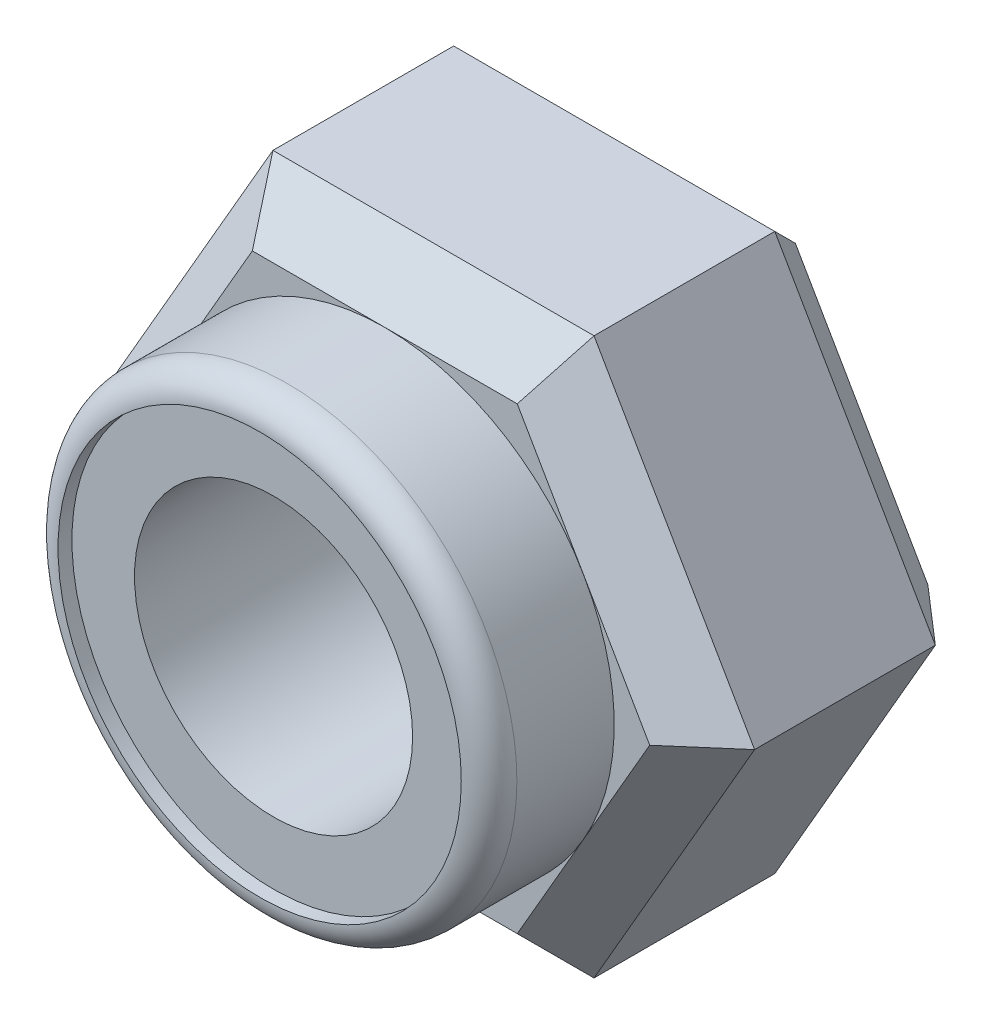
ISO-10303-21;
HEADER;
FILE_DESCRIPTION(('STEP AP214'),'2;1');
FILE_NAME('part.step','',(''),(''),'','','');
FILE_SCHEMA(('AUTOMOTIVE_DESIGN { 1 0 10303 214 1 1 1 1 }'));
ENDSEC;
DATA;
#1=APPLICATION_CONTEXT('core data for automotive mechanical design processes');
#2=APPLICATION_PROTOCOL_DEFINITION('international standard','automotive_design',2000,#1);
#3=PRODUCT_CONTEXT('',#1,'mechanical');
#4=PRODUCT('Part','Part','',(#3));
#5=PRODUCT_RELATED_PRODUCT_CATEGORY('part','',(#4));
#6=PRODUCT_DEFINITION_FORMATION('','',#4);
#7=PRODUCT_DEFINITION_CONTEXT('part definition',#1,'design');
#8=PRODUCT_DEFINITION('design','',#6,#7);
#9=PRODUCT_DEFINITION_SHAPE('','',#8);
#10=(LENGTH_UNIT() NAMED_UNIT(*) SI_UNIT(.MILLI.,.METRE.));
#11=(NAMED_UNIT(*) PLANE_ANGLE_UNIT() SI_UNIT($,.RADIAN.));
#12=(NAMED_UNIT(*) SI_UNIT($,.STERADIAN.) SOLID_ANGLE_UNIT());
#13=UNCERTAINTY_MEASURE_WITH_UNIT(LENGTH_MEASURE(1.E-05),#10,'distance_accuracy_value','');
#14=(GEOMETRIC_REPRESENTATION_CONTEXT(3) GLOBAL_UNCERTAINTY_ASSIGNED_CONTEXT((#13)) GLOBAL_UNIT_ASSIGNED_CONTEXT((#10,
#11,#12)) REPRESENTATION_CONTEXT('',''));
#15=CARTESIAN_POINT('',(0.,0.,0.));
#16=DIRECTION('',(0.,0.,1.));
#17=DIRECTION('',(1.,0.,0.));
#18=AXIS2_PLACEMENT_3D('',#15,#16,#17);
#19=CARTESIAN_POINT('',(0.,0.,2.));
#20=DIRECTION('',(0.,0.,-1.));
#21=DIRECTION('',(-1.,0.,0.));
#22=AXIS2_PLACEMENT_3D('',#19,#20,#21);
#23=CYLINDRICAL_SURFACE('',#22,1.);
#24=CARTESIAN_POINT('',(0.,0.,0.));
#25=DIRECTION('',(0.,0.,1.));
#26=DIRECTION('',(1.,0.,0.));
#27=AXIS2_PLACEMENT_3D('',#24,#25,#26);
#28=CIRCLE('',#27,1.);
#29=CARTESIAN_POINT('',(1.,0.,0.));
#30=VERTEX_POINT('',#29);
#31=EDGE_CURVE('E178',#30,#30,#28,.T.);
#32=ORIENTED_EDGE('',*,*,#31,.F.);
#33=EDGE_LOOP('',(#32));
#34=FACE_BOUND('',#33,.T.);
#35=CARTESIAN_POINT('',(0.,0.,2.8));
#36=DIRECTION('',(0.,0.,1.));
#37=DIRECTION('',(1.,0.,0.));
#38=AXIS2_PLACEMENT_3D('',#35,#36,#37);
#39=CIRCLE('',#38,1.);
#40=CARTESIAN_POINT('',(1.,0.,2.8));
#41=VERTEX_POINT('',#40);
#42=EDGE_CURVE('E393',#41,#41,#39,.T.);
#43=ORIENTED_EDGE('',*,*,#42,.T.);
#44=EDGE_LOOP('',(#43));
#45=FACE_BOUND('',#44,.T.);
#46=ADVANCED_FACE('F36',(#34,#45),#23,.F.);
#47=CARTESIAN_POINT('',(0.,0.,2.));
#48=DIRECTION('',(0.,0.,1.));
#49=DIRECTION('',(1.,0.,0.));
#50=AXIS2_PLACEMENT_3D('',#47,#48,#49);
#51=PLANE('',#50);
#52=CARTESIAN_POINT('',(0.,0.,2.));
#53=DIRECTION('',(0.,0.,1.));
#54=DIRECTION('',(1.,0.,0.));
#55=AXIS2_PLACEMENT_3D('',#52,#53,#54);
#56=CIRCLE('',#55,1.65);
#57=CARTESIAN_POINT('',(1.42894191624432,0.825,2.));
#58=VERTEX_POINT('',#57);
#59=CARTESIAN_POINT('',(0.,1.65,2.));
#60=VERTEX_POINT('',#59);
#61=EDGE_CURVE('E166',#58,#60,#56,.T.);
#62=ORIENTED_EDGE('',*,*,#61,.F.);
#63=DIRECTION('',(-0.5,0.866025403784439,0.));
#64=VECTOR('',#63,1.);
#65=CARTESIAN_POINT('',(0.851591647054698,1.825,2.));
#66=LINE('',#65,#64);
#67=CARTESIAN_POINT('',(0.952627944162882,1.65,2.));
#68=VERTEX_POINT('',#67);
#69=EDGE_CURVE('E153',#58,#68,#66,.T.);
#70=ORIENTED_EDGE('',*,*,#69,.T.);
#71=DIRECTION('',(-1.,0.,0.));
#72=VECTOR('',#71,1.);
#73=CARTESIAN_POINT('',(-1.15470053837925,1.65,2.));
#74=LINE('',#73,#72);
#75=EDGE_CURVE('E168',#68,#60,#74,.T.);
#76=ORIENTED_EDGE('',*,*,#75,.T.);
#77=EDGE_LOOP('',(#62,#70,#76));
#78=FACE_BOUND('',#77,.T.);
#79=ADVANCED_FACE('F167',(#78),#51,.T.);
#80=CARTESIAN_POINT('',(-1.42894191624432,0.824999999999999,2.));
#81=VERTEX_POINT('',#80);
#82=EDGE_CURVE('E44',#60,#81,#56,.T.);
#83=ORIENTED_EDGE('',*,*,#82,.F.);
#84=CARTESIAN_POINT('',(-0.952627944162882,1.65,2.));
#85=VERTEX_POINT('',#84);
#86=EDGE_CURVE('E239',#60,#85,#74,.T.);
#87=ORIENTED_EDGE('',*,*,#86,.T.);
#88=DIRECTION('',(-0.5,-0.866025403784439,0.));
#89=VECTOR('',#88,1.);
#90=CARTESIAN_POINT('',(-2.00629218543395,-0.175000000000001,2.));
#91=LINE('',#90,#89);
#92=EDGE_CURVE('E242',#85,#81,#91,.T.);
#93=ORIENTED_EDGE('',*,*,#92,.T.);
#94=EDGE_LOOP('',(#83,#87,#93));
#95=FACE_BOUND('',#94,.T.);
#96=ADVANCED_FACE('F352',(#95),#51,.T.);
#97=CARTESIAN_POINT('',(-1.42894191624432,-0.825,2.));
#98=VERTEX_POINT('',#97);
#99=EDGE_CURVE('E359',#81,#98,#56,.T.);
#100=ORIENTED_EDGE('',*,*,#99,.F.);
#101=CARTESIAN_POINT('',(-1.90525588832576,0.,2.));
#102=VERTEX_POINT('',#101);
#103=EDGE_CURVE('E241',#81,#102,#91,.T.);
#104=ORIENTED_EDGE('',*,*,#103,.T.);
#105=DIRECTION('',(0.5,-0.866025403784439,0.));
#106=VECTOR('',#105,1.);
#107=CARTESIAN_POINT('',(-0.851591647054698,-1.825,2.));
#108=LINE('',#107,#106);
#109=EDGE_CURVE('E246',#102,#98,#108,.T.);
#110=ORIENTED_EDGE('',*,*,#109,.T.);
#111=EDGE_LOOP('',(#100,#104,#110));
#112=FACE_BOUND('',#111,.T.);
#113=ADVANCED_FACE('F357',(#112),#51,.T.);
#114=CARTESIAN_POINT('',(0.,-1.65,2.));
#115=VERTEX_POINT('',#114);
#116=EDGE_CURVE('E59',#98,#115,#56,.T.);
#117=ORIENTED_EDGE('',*,*,#116,.F.);
#118=CARTESIAN_POINT('',(-0.952627944162882,-1.65,2.));
#119=VERTEX_POINT('',#118);
#120=EDGE_CURVE('E245',#98,#119,#108,.T.);
#121=ORIENTED_EDGE('',*,*,#120,.T.);
#122=DIRECTION('',(1.,0.,0.));
#123=VECTOR('',#122,1.);
#124=CARTESIAN_POINT('',(1.15470053837925,-1.65,2.));
#125=LINE('',#124,#123);
#126=EDGE_CURVE('E250',#119,#115,#125,.T.);
#127=ORIENTED_EDGE('',*,*,#126,.T.);
#128=EDGE_LOOP('',(#117,#121,#127));
#129=FACE_BOUND('',#128,.T.);
#130=ADVANCED_FACE('F361',(#129),#51,.T.);
#131=CARTESIAN_POINT('',(1.42894191624432,-0.824999999999999,2.));
#132=VERTEX_POINT('',#131);
#133=EDGE_CURVE('E51',#115,#132,#56,.T.);
#134=ORIENTED_EDGE('',*,*,#133,.F.);
#135=CARTESIAN_POINT('',(0.952627944162882,-1.65,2.));
#136=VERTEX_POINT('',#135);
#137=EDGE_CURVE('E249',#115,#136,#125,.T.);
#138=ORIENTED_EDGE('',*,*,#137,.T.);
#139=DIRECTION('',(0.5,0.866025403784439,0.));
#140=VECTOR('',#139,1.);
#141=CARTESIAN_POINT('',(2.00629218543395,0.175000000000002,2.));
#142=LINE('',#141,#140);
#143=EDGE_CURVE('E164',#136,#132,#142,.T.);
#144=ORIENTED_EDGE('',*,*,#143,.T.);
#145=EDGE_LOOP('',(#134,#138,#144));
#146=FACE_BOUND('',#145,.T.);
#147=ADVANCED_FACE('F367',(#146),#51,.T.);
#148=EDGE_CURVE('E148',#132,#58,#56,.T.);
#149=ORIENTED_EDGE('',*,*,#148,.F.);
#150=CARTESIAN_POINT('',(1.90525588832576,0.,2.));
#151=VERTEX_POINT('',#150);
#152=EDGE_CURVE('E150',#132,#151,#142,.T.);
#153=ORIENTED_EDGE('',*,*,#152,.T.);
#154=EDGE_CURVE('E144',#151,#58,#66,.T.);
#155=ORIENTED_EDGE('',*,*,#154,.T.);
#156=EDGE_LOOP('',(#149,#153,#155));
#157=FACE_BOUND('',#156,.T.);
#158=ADVANCED_FACE('F146',(#157),#51,.T.);
#159=CARTESIAN_POINT('',(0.,0.,0.));
#160=DIRECTION('',(0.,0.,1.));
#161=DIRECTION('',(1.,0.,0.));
#162=AXIS2_PLACEMENT_3D('',#159,#160,#161);
#163=PLANE('',#162);
#164=DIRECTION('',(0.5,-0.866025403784439,0.));
#165=VECTOR('',#164,1.);
#166=CARTESIAN_POINT('',(1.42894191624432,0.825,0.));
#167=LINE('',#166,#165);
#168=CARTESIAN_POINT('',(0.952627944162882,1.65,0.));
#169=VERTEX_POINT('',#168);
#170=CARTESIAN_POINT('',(1.90525588832576,0.,0.));
#171=VERTEX_POINT('',#170);
#172=EDGE_CURVE('E205',#169,#171,#167,.T.);
#173=ORIENTED_EDGE('',*,*,#172,.T.);
#174=DIRECTION('',(-0.5,-0.866025403784439,0.));
#175=VECTOR('',#174,1.);
#176=CARTESIAN_POINT('',(1.42894191624432,-0.824999999999999,0.));
#177=LINE('',#176,#175);
#178=CARTESIAN_POINT('',(0.952627944162882,-1.65,0.));
#179=VERTEX_POINT('',#178);
#180=EDGE_CURVE('E215',#171,#179,#177,.T.);
#181=ORIENTED_EDGE('',*,*,#180,.T.);
#182=DIRECTION('',(-1.,0.,0.));
#183=VECTOR('',#182,1.);
#184=CARTESIAN_POINT('',(0.,-1.65,0.));
#185=LINE('',#184,#183);
#186=CARTESIAN_POINT('',(-0.952627944162882,-1.65,0.));
#187=VERTEX_POINT('',#186);
#188=EDGE_CURVE('E213',#179,#187,#185,.T.);
#189=ORIENTED_EDGE('',*,*,#188,.T.);
#190=DIRECTION('',(-0.5,0.866025403784439,0.));
#191=VECTOR('',#190,1.);
#192=CARTESIAN_POINT('',(-1.42894191624432,-0.824999999999999,0.));
#193=LINE('',#192,#191);
#194=CARTESIAN_POINT('',(-1.90525588832576,0.,0.));
#195=VERTEX_POINT('',#194);
#196=EDGE_CURVE('E211',#187,#195,#193,.T.);
#197=ORIENTED_EDGE('',*,*,#196,.T.);
#198=DIRECTION('',(0.5,0.866025403784439,0.));
#199=VECTOR('',#198,1.);
#200=CARTESIAN_POINT('',(-1.42894191624432,0.824999999999999,0.));
#201=LINE('',#200,#199);
#202=CARTESIAN_POINT('',(-0.952627944162882,1.65,0.));
#203=VERTEX_POINT('',#202);
#204=EDGE_CURVE('E209',#195,#203,#201,.T.);
#205=ORIENTED_EDGE('',*,*,#204,.T.);
#206=DIRECTION('',(1.,0.,0.));
#207=VECTOR('',#206,1.);
#208=CARTESIAN_POINT('',(0.,1.65,0.));
#209=LINE('',#208,#207);
#210=EDGE_CURVE('E207',#203,#169,#209,.T.);
#211=ORIENTED_EDGE('',*,*,#210,.T.);
#212=EDGE_LOOP('',(#173,#181,#189,#197,#205,#211));
#213=FACE_BOUND('',#212,.T.);
#214=ORIENTED_EDGE('',*,*,#31,.T.);
#215=EDGE_LOOP('',(#214));
#216=FACE_BOUND('',#215,.T.);
#217=ADVANCED_FACE('F314',(#213,#216),#163,.F.);
#218=CARTESIAN_POINT('',(-2.3094010767585,0.,2.));
#219=DIRECTION('',(0.866025403784439,0.5,0.));
#220=DIRECTION('',(-0.5,0.866025403784439,0.));
#221=AXIS2_PLACEMENT_3D('',#218,#219,#220);
#222=PLANE('',#221);
#223=DIRECTION('',(0.,0.,-1.));
#224=VECTOR('',#223,1.);
#225=CARTESIAN_POINT('',(-2.3094010767585,0.,2.));
#226=LINE('',#225,#224);
#227=CARTESIAN_POINT('',(-2.3094010767585,0.,1.65));
#228=VERTEX_POINT('',#227);
#229=CARTESIAN_POINT('',(-2.3094010767585,0.,0.35));
#230=VERTEX_POINT('',#229);
#231=EDGE_CURVE('E181',#228,#230,#226,.T.);
#232=ORIENTED_EDGE('',*,*,#231,.T.);
#233=DIRECTION('',(0.5,-0.866025403784439,0.));
#234=VECTOR('',#233,1.);
#235=CARTESIAN_POINT('',(-2.3094010767585,0.,0.35));
#236=LINE('',#235,#234);
#237=CARTESIAN_POINT('',(-1.15470053837925,-2.,0.35));
#238=VERTEX_POINT('',#237);
#239=EDGE_CURVE('E224',#230,#238,#236,.T.);
#240=ORIENTED_EDGE('',*,*,#239,.T.);
#241=DIRECTION('',(0.,0.,-1.));
#242=VECTOR('',#241,1.);
#243=CARTESIAN_POINT('',(-1.15470053837925,-2.,2.));
#244=LINE('',#243,#242);
#245=CARTESIAN_POINT('',(-1.15470053837925,-2.,1.65));
#246=VERTEX_POINT('',#245);
#247=EDGE_CURVE('E197',#246,#238,#244,.T.);
#248=ORIENTED_EDGE('',*,*,#247,.F.);
#249=DIRECTION('',(-0.5,0.866025403784439,0.));
#250=VECTOR('',#249,1.);
#251=CARTESIAN_POINT('',(-2.3094010767585,0.,1.65));
#252=LINE('',#251,#250);
#253=EDGE_CURVE('E222',#246,#228,#252,.T.);
#254=ORIENTED_EDGE('',*,*,#253,.T.);
#255=EDGE_LOOP('',(#232,#240,#248,#254));
#256=FACE_BOUND('',#255,.T.);
#257=ADVANCED_FACE('F296',(#256),#222,.F.);
#258=CARTESIAN_POINT('',(-1.15470053837925,-2.,2.));
#259=DIRECTION('',(0.,1.,0.));
#260=DIRECTION('',(0.,0.,1.));
#261=AXIS2_PLACEMENT_3D('',#258,#259,#260);
#262=PLANE('',#261);
#263=ORIENTED_EDGE('',*,*,#247,.T.);
#264=DIRECTION('',(1.,0.,0.));
#265=VECTOR('',#264,1.);
#266=CARTESIAN_POINT('',(-1.15470053837925,-2.,0.35));
#267=LINE('',#266,#265);
#268=CARTESIAN_POINT('',(1.15470053837925,-2.,0.35));
#269=VERTEX_POINT('',#268);
#270=EDGE_CURVE('E220',#238,#269,#267,.T.);
#271=ORIENTED_EDGE('',*,*,#270,.T.);
#272=DIRECTION('',(0.,0.,-1.));
#273=VECTOR('',#272,1.);
#274=CARTESIAN_POINT('',(1.15470053837925,-2.,2.));
#275=LINE('',#274,#273);
#276=CARTESIAN_POINT('',(1.15470053837925,-2.,1.65));
#277=VERTEX_POINT('',#276);
#278=EDGE_CURVE('E194',#277,#269,#275,.T.);
#279=ORIENTED_EDGE('',*,*,#278,.F.);
#280=DIRECTION('',(-1.,0.,0.));
#281=VECTOR('',#280,1.);
#282=CARTESIAN_POINT('',(-1.15470053837925,-2.,1.65));
#283=LINE('',#282,#281);
#284=EDGE_CURVE('E218',#277,#246,#283,.T.);
#285=ORIENTED_EDGE('',*,*,#284,.T.);
#286=EDGE_LOOP('',(#263,#271,#279,#285));
#287=FACE_BOUND('',#286,.T.);
#288=ADVANCED_FACE('F323',(#287),#262,.F.);
#289=CARTESIAN_POINT('',(1.15470053837925,-2.,2.));
#290=DIRECTION('',(-0.866025403784439,0.5,0.));
#291=DIRECTION('',(-0.5,-0.866025403784439,0.));
#292=AXIS2_PLACEMENT_3D('',#289,#290,#291);
#293=PLANE('',#292);
#294=ORIENTED_EDGE('',*,*,#278,.T.);
#295=DIRECTION('',(0.5,0.866025403784439,0.));
#296=VECTOR('',#295,1.);
#297=CARTESIAN_POINT('',(1.15470053837925,-2.,0.35));
#298=LINE('',#297,#296);
#299=CARTESIAN_POINT('',(2.3094010767585,0.,0.35));
#300=VERTEX_POINT('',#299);
#301=EDGE_CURVE('E202',#269,#300,#298,.T.);
#302=ORIENTED_EDGE('',*,*,#301,.T.);
#303=DIRECTION('',(0.,0.,-1.));
#304=VECTOR('',#303,1.);
#305=CARTESIAN_POINT('',(2.3094010767585,0.,2.));
#306=LINE('',#305,#304);
#307=CARTESIAN_POINT('',(2.3094010767585,0.,1.65));
#308=VERTEX_POINT('',#307);
#309=EDGE_CURVE('E191',#308,#300,#306,.T.);
#310=ORIENTED_EDGE('',*,*,#309,.F.);
#311=DIRECTION('',(-0.5,-0.866025403784439,0.));
#312=VECTOR('',#311,1.);
#313=CARTESIAN_POINT('',(1.15470053837925,-2.,1.65));
#314=LINE('',#313,#312);
#315=EDGE_CURVE('E200',#308,#277,#314,.T.);
#316=ORIENTED_EDGE('',*,*,#315,.T.);
#317=EDGE_LOOP('',(#294,#302,#310,#316));
#318=FACE_BOUND('',#317,.T.);
#319=ADVANCED_FACE('F327',(#318),#293,.F.);
#320=CARTESIAN_POINT('',(2.3094010767585,0.,2.));
#321=DIRECTION('',(-0.866025403784439,-0.5,0.));
#322=DIRECTION('',(0.5,-0.866025403784439,0.));
#323=AXIS2_PLACEMENT_3D('',#320,#321,#322);
#324=PLANE('',#323);
#325=ORIENTED_EDGE('',*,*,#309,.T.);
#326=DIRECTION('',(-0.5,0.866025403784439,0.));
#327=VECTOR('',#326,1.);
#328=CARTESIAN_POINT('',(2.3094010767585,0.,0.35));
#329=LINE('',#328,#327);
#330=CARTESIAN_POINT('',(1.15470053837925,2.,0.35));
#331=VERTEX_POINT('',#330);
#332=EDGE_CURVE('E237',#300,#331,#329,.T.);
#333=ORIENTED_EDGE('',*,*,#332,.T.);
#334=DIRECTION('',(0.,0.,-1.));
#335=VECTOR('',#334,1.);
#336=CARTESIAN_POINT('',(1.15470053837925,2.,2.));
#337=LINE('',#336,#335);
#338=CARTESIAN_POINT('',(1.15470053837925,2.,1.65));
#339=VERTEX_POINT('',#338);
#340=EDGE_CURVE('E188',#339,#331,#337,.T.);
#341=ORIENTED_EDGE('',*,*,#340,.F.);
#342=DIRECTION('',(0.5,-0.866025403784439,0.));
#343=VECTOR('',#342,1.);
#344=CARTESIAN_POINT('',(2.3094010767585,0.,1.65));
#345=LINE('',#344,#343);
#346=EDGE_CURVE('E234',#339,#308,#345,.T.);
#347=ORIENTED_EDGE('',*,*,#346,.T.);
#348=EDGE_LOOP('',(#325,#333,#341,#347));
#349=FACE_BOUND('',#348,.T.);
#350=ADVANCED_FACE('F342',(#349),#324,.F.);
#351=CARTESIAN_POINT('',(1.15470053837925,2.,2.));
#352=DIRECTION('',(0.,-1.,0.));
#353=DIRECTION('',(1.,0.,0.));
#354=AXIS2_PLACEMENT_3D('',#351,#352,#353);
#355=PLANE('',#354);
#356=ORIENTED_EDGE('',*,*,#340,.T.);
#357=DIRECTION('',(-1.,0.,0.));
#358=VECTOR('',#357,1.);
#359=CARTESIAN_POINT('',(1.15470053837925,2.,0.35));
#360=LINE('',#359,#358);
#361=CARTESIAN_POINT('',(-1.15470053837925,2.,0.35));
#362=VERTEX_POINT('',#361);
#363=EDGE_CURVE('E232',#331,#362,#360,.T.);
#364=ORIENTED_EDGE('',*,*,#363,.T.);
#365=DIRECTION('',(0.,0.,-1.));
#366=VECTOR('',#365,1.);
#367=CARTESIAN_POINT('',(-1.15470053837925,2.,2.));
#368=LINE('',#367,#366);
#369=CARTESIAN_POINT('',(-1.15470053837925,2.,1.65));
#370=VERTEX_POINT('',#369);
#371=EDGE_CURVE('E185',#370,#362,#368,.T.);
#372=ORIENTED_EDGE('',*,*,#371,.F.);
#373=DIRECTION('',(1.,0.,0.));
#374=VECTOR('',#373,1.);
#375=CARTESIAN_POINT('',(1.15470053837925,2.,1.65));
#376=LINE('',#375,#374);
#377=EDGE_CURVE('E230',#370,#339,#376,.T.);
#378=ORIENTED_EDGE('',*,*,#377,.T.);
#379=EDGE_LOOP('',(#356,#364,#372,#378));
#380=FACE_BOUND('',#379,.T.);
#381=ADVANCED_FACE('F344',(#380),#355,.F.);
#382=CARTESIAN_POINT('',(-1.15470053837925,2.,2.));
#383=DIRECTION('',(0.866025403784439,-0.5,0.));
#384=DIRECTION('',(0.5,0.866025403784439,0.));
#385=AXIS2_PLACEMENT_3D('',#382,#383,#384);
#386=PLANE('',#385);
#387=ORIENTED_EDGE('',*,*,#371,.T.);
#388=DIRECTION('',(-0.5,-0.866025403784439,0.));
#389=VECTOR('',#388,1.);
#390=CARTESIAN_POINT('',(-1.15470053837925,2.,0.35));
#391=LINE('',#390,#389);
#392=EDGE_CURVE('E228',#362,#230,#391,.T.);
#393=ORIENTED_EDGE('',*,*,#392,.T.);
#394=ORIENTED_EDGE('',*,*,#231,.F.);
#395=DIRECTION('',(0.5,0.866025403784439,0.));
#396=VECTOR('',#395,1.);
#397=CARTESIAN_POINT('',(-1.15470053837925,2.,1.65));
#398=LINE('',#397,#396);
#399=EDGE_CURVE('E226',#228,#370,#398,.T.);
#400=ORIENTED_EDGE('',*,*,#399,.T.);
#401=EDGE_LOOP('',(#387,#393,#394,#400));
#402=FACE_BOUND('',#401,.T.);
#403=ADVANCED_FACE('F299',(#402),#386,.F.);
#404=CARTESIAN_POINT('',(-1.15470053837925,2.,0.35));
#405=DIRECTION('',(0.612372435695793,-0.353553390593273,0.707106781186549));
#406=DIRECTION('',(-0.5,-0.866025403784439,0.));
#407=AXIS2_PLACEMENT_3D('',#404,#405,#406);
#408=PLANE('',#407);
#409=DIRECTION('',(-0.377964473009228,0.654653670707979,0.654653670707975));
#410=VECTOR('',#409,1.);
#411=CARTESIAN_POINT('',(-0.824786098842322,1.42857142857143,-0.221428571428571));
#412=LINE('',#411,#410);
#413=EDGE_CURVE('E264',#203,#362,#412,.T.);
#414=ORIENTED_EDGE('',*,*,#413,.F.);
#415=ORIENTED_EDGE('',*,*,#204,.F.);
#416=DIRECTION('',(-0.755928946018456,0.,0.654653670707975));
#417=VECTOR('',#416,1.);
#418=CARTESIAN_POINT('',(-1.64957219768464,0.,-0.221428571428572));
#419=LINE('',#418,#417);
#420=EDGE_CURVE('E182',#230,#195,#419,.F.);
#421=ORIENTED_EDGE('',*,*,#420,.F.);
#422=ORIENTED_EDGE('',*,*,#392,.F.);
#423=EDGE_LOOP('',(#414,#415,#421,#422));
#424=FACE_BOUND('',#423,.T.);
#425=ADVANCED_FACE('F304',(#424),#408,.F.);
#426=CARTESIAN_POINT('',(-2.3094010767585,0.,0.35));
#427=DIRECTION('',(0.612372435695793,0.353553390593273,0.70710678118655));
#428=DIRECTION('',(0.5,-0.866025403784439,0.));
#429=AXIS2_PLACEMENT_3D('',#426,#427,#428);
#430=PLANE('',#429);
#431=ORIENTED_EDGE('',*,*,#420,.T.);
#432=ORIENTED_EDGE('',*,*,#196,.F.);
#433=DIRECTION('',(-0.377964473009228,-0.654653670707979,0.654653670707975));
#434=VECTOR('',#433,1.);
#435=CARTESIAN_POINT('',(-0.824786098842321,-1.42857142857143,-0.221428571428571));
#436=LINE('',#435,#434);
#437=EDGE_CURVE('E261',#238,#187,#436,.F.);
#438=ORIENTED_EDGE('',*,*,#437,.F.);
#439=ORIENTED_EDGE('',*,*,#239,.F.);
#440=EDGE_LOOP('',(#431,#432,#438,#439));
#441=FACE_BOUND('',#440,.T.);
#442=ADVANCED_FACE('F319',(#441),#430,.F.);
#443=CARTESIAN_POINT('',(1.15470053837925,2.,0.35));
#444=DIRECTION('',(0.,-0.707106781186545,0.707106781186549));
#445=DIRECTION('',(-1.,0.,0.));
#446=AXIS2_PLACEMENT_3D('',#443,#444,#445);
#447=PLANE('',#446);
#448=ORIENTED_EDGE('',*,*,#413,.T.);
#449=ORIENTED_EDGE('',*,*,#363,.F.);
#450=DIRECTION('',(0.377964473009228,0.654653670707979,0.654653670707975));
#451=VECTOR('',#450,1.);
#452=CARTESIAN_POINT('',(0.824786098842322,1.42857142857143,-0.221428571428571));
#453=LINE('',#452,#451);
#454=EDGE_CURVE('E258',#169,#331,#453,.T.);
#455=ORIENTED_EDGE('',*,*,#454,.F.);
#456=ORIENTED_EDGE('',*,*,#210,.F.);
#457=EDGE_LOOP('',(#448,#449,#455,#456));
#458=FACE_BOUND('',#457,.T.);
#459=ADVANCED_FACE('F310',(#458),#447,.F.);
#460=CARTESIAN_POINT('',(-1.15470053837925,-2.,0.35));
#461=DIRECTION('',(0.,0.707106781186545,0.707106781186549));
#462=DIRECTION('',(1.,0.,0.));
#463=AXIS2_PLACEMENT_3D('',#460,#461,#462);
#464=PLANE('',#463);
#465=ORIENTED_EDGE('',*,*,#437,.T.);
#466=ORIENTED_EDGE('',*,*,#188,.F.);
#467=DIRECTION('',(0.377964473009228,-0.654653670707979,0.654653670707975));
#468=VECTOR('',#467,1.);
#469=CARTESIAN_POINT('',(0.824786098842322,-1.42857142857143,-0.221428571428571));
#470=LINE('',#469,#468);
#471=EDGE_CURVE('E255',#269,#179,#470,.F.);
#472=ORIENTED_EDGE('',*,*,#471,.F.);
#473=ORIENTED_EDGE('',*,*,#270,.F.);
#474=EDGE_LOOP('',(#465,#466,#472,#473));
#475=FACE_BOUND('',#474,.T.);
#476=ADVANCED_FACE('F333',(#475),#464,.F.);
#477=CARTESIAN_POINT('',(2.3094010767585,0.,0.35));
#478=DIRECTION('',(-0.612372435695793,-0.353553390593273,0.707106781186549));
#479=DIRECTION('',(-0.5,0.866025403784439,0.));
#480=AXIS2_PLACEMENT_3D('',#477,#478,#479);
#481=PLANE('',#480);
#482=ORIENTED_EDGE('',*,*,#454,.T.);
#483=ORIENTED_EDGE('',*,*,#332,.F.);
#484=DIRECTION('',(-0.755928946018456,0.,-0.654653670707975));
#485=VECTOR('',#484,1.);
#486=CARTESIAN_POINT('',(2.3094010767585,0.,0.35));
#487=LINE('',#486,#485);
#488=EDGE_CURVE('E253',#171,#300,#487,.F.);
#489=ORIENTED_EDGE('',*,*,#488,.F.);
#490=ORIENTED_EDGE('',*,*,#172,.F.);
#491=EDGE_LOOP('',(#482,#483,#489,#490));
#492=FACE_BOUND('',#491,.T.);
#493=ADVANCED_FACE('F339',(#492),#481,.F.);
#494=CARTESIAN_POINT('',(1.15470053837925,-2.,0.35));
#495=DIRECTION('',(-0.612372435695793,0.353553390593273,0.707106781186549));
#496=DIRECTION('',(0.5,0.866025403784439,0.));
#497=AXIS2_PLACEMENT_3D('',#494,#495,#496);
#498=PLANE('',#497);
#499=ORIENTED_EDGE('',*,*,#471,.T.);
#500=ORIENTED_EDGE('',*,*,#180,.F.);
#501=ORIENTED_EDGE('',*,*,#488,.T.);
#502=ORIENTED_EDGE('',*,*,#301,.F.);
#503=EDGE_LOOP('',(#499,#500,#501,#502));
#504=FACE_BOUND('',#503,.T.);
#505=ADVANCED_FACE('F335',(#504),#498,.F.);
#506=CARTESIAN_POINT('',(-1.42894191624432,-0.825,2.));
#507=DIRECTION('',(-0.612372435695796,-0.353553390593275,0.707106781186546));
#508=DIRECTION('',(-0.5,0.866025403784439,0.));
#509=AXIS2_PLACEMENT_3D('',#506,#507,#508);
#510=PLANE('',#509);
#511=DIRECTION('',(0.755928946018453,0.,0.654653670707979));
#512=VECTOR('',#511,1.);
#513=CARTESIAN_POINT('',(-1.6330764757078,0.,2.23571428571429));
#514=LINE('',#513,#512);
#515=EDGE_CURVE('E278',#228,#102,#514,.T.);
#516=ORIENTED_EDGE('',*,*,#515,.F.);
#517=ORIENTED_EDGE('',*,*,#253,.F.);
#518=DIRECTION('',(0.377964473009227,0.654653670707976,0.654653670707979));
#519=VECTOR('',#518,1.);
#520=CARTESIAN_POINT('',(-0.8165382378539,-1.41428571428572,2.23571428571429));
#521=LINE('',#520,#519);
#522=EDGE_CURVE('E256',#119,#246,#521,.F.);
#523=ORIENTED_EDGE('',*,*,#522,.F.);
#524=ORIENTED_EDGE('',*,*,#120,.F.);
#525=ORIENTED_EDGE('',*,*,#109,.F.);
#526=EDGE_LOOP('',(#516,#517,#523,#524,#525));
#527=FACE_BOUND('',#526,.T.);
#528=ADVANCED_FACE('F290',(#527),#510,.T.);
#529=CARTESIAN_POINT('',(0.,-1.65,2.));
#530=DIRECTION('',(0.,-0.707106781186549,0.707106781186546));
#531=DIRECTION('',(-1.,0.,0.));
#532=AXIS2_PLACEMENT_3D('',#529,#530,#531);
#533=PLANE('',#532);
#534=ORIENTED_EDGE('',*,*,#522,.T.);
#535=ORIENTED_EDGE('',*,*,#284,.F.);
#536=DIRECTION('',(-0.377964473009227,0.654653670707976,0.654653670707979));
#537=VECTOR('',#536,1.);
#538=CARTESIAN_POINT('',(0.816538237853899,-1.41428571428572,2.23571428571429));
#539=LINE('',#538,#537);
#540=EDGE_CURVE('E275',#136,#277,#539,.F.);
#541=ORIENTED_EDGE('',*,*,#540,.F.);
#542=ORIENTED_EDGE('',*,*,#137,.F.);
#543=ORIENTED_EDGE('',*,*,#126,.F.);
#544=EDGE_LOOP('',(#534,#535,#541,#542,#543));
#545=FACE_BOUND('',#544,.T.);
#546=ADVANCED_FACE('F285',(#545),#533,.T.);
#547=CARTESIAN_POINT('',(-1.42894191624432,0.824999999999999,2.));
#548=DIRECTION('',(-0.612372435695796,0.353553390593274,0.707106781186546));
#549=DIRECTION('',(0.5,0.866025403784439,0.));
#550=AXIS2_PLACEMENT_3D('',#547,#548,#549);
#551=PLANE('',#550);
#552=ORIENTED_EDGE('',*,*,#515,.T.);
#553=ORIENTED_EDGE('',*,*,#103,.F.);
#554=ORIENTED_EDGE('',*,*,#92,.F.);
#555=DIRECTION('',(0.377964473009227,-0.654653670707975,0.654653670707979));
#556=VECTOR('',#555,1.);
#557=CARTESIAN_POINT('',(-0.8165382378539,1.41428571428571,2.23571428571429));
#558=LINE('',#557,#556);
#559=EDGE_CURVE('E272',#370,#85,#558,.T.);
#560=ORIENTED_EDGE('',*,*,#559,.F.);
#561=ORIENTED_EDGE('',*,*,#399,.F.);
#562=EDGE_LOOP('',(#552,#553,#554,#560,#561));
#563=FACE_BOUND('',#562,.T.);
#564=ADVANCED_FACE('F355',(#563),#551,.T.);
#565=CARTESIAN_POINT('',(1.42894191624432,-0.824999999999999,2.));
#566=DIRECTION('',(0.612372435695796,-0.353553390593274,0.707106781186546));
#567=DIRECTION('',(-0.5,-0.866025403784439,0.));
#568=AXIS2_PLACEMENT_3D('',#565,#566,#567);
#569=PLANE('',#568);
#570=ORIENTED_EDGE('',*,*,#540,.T.);
#571=ORIENTED_EDGE('',*,*,#315,.F.);
#572=DIRECTION('',(-0.755928946018453,0.,0.654653670707979));
#573=VECTOR('',#572,1.);
#574=CARTESIAN_POINT('',(1.6330764757078,0.,2.23571428571429));
#575=LINE('',#574,#573);
#576=EDGE_CURVE('E270',#151,#308,#575,.F.);
#577=ORIENTED_EDGE('',*,*,#576,.F.);
#578=ORIENTED_EDGE('',*,*,#152,.F.);
#579=ORIENTED_EDGE('',*,*,#143,.F.);
#580=EDGE_LOOP('',(#570,#571,#577,#578,#579));
#581=FACE_BOUND('',#580,.T.);
#582=ADVANCED_FACE('F488',(#581),#569,.T.);
#583=CARTESIAN_POINT('',(0.,1.65,2.));
#584=DIRECTION('',(0.,0.707106781186549,0.707106781186546));
#585=DIRECTION('',(1.,0.,0.));
#586=AXIS2_PLACEMENT_3D('',#583,#584,#585);
#587=PLANE('',#586);
#588=ORIENTED_EDGE('',*,*,#559,.T.);
#589=ORIENTED_EDGE('',*,*,#86,.F.);
#590=ORIENTED_EDGE('',*,*,#75,.F.);
#591=DIRECTION('',(0.377964473009226,0.654653670707976,-0.654653670707979));
#592=VECTOR('',#591,1.);
#593=CARTESIAN_POINT('',(0.8165382378539,1.41428571428572,2.23571428571429));
#594=LINE('',#593,#592);
#595=EDGE_CURVE('E160',#339,#68,#594,.F.);
#596=ORIENTED_EDGE('',*,*,#595,.F.);
#597=ORIENTED_EDGE('',*,*,#377,.F.);
#598=EDGE_LOOP('',(#588,#589,#590,#596,#597));
#599=FACE_BOUND('',#598,.T.);
#600=ADVANCED_FACE('F348',(#599),#587,.T.);
#601=CARTESIAN_POINT('',(1.42894191624432,0.825,2.));
#602=DIRECTION('',(0.612372435695796,0.353553390593275,0.707106781186546));
#603=DIRECTION('',(0.5,-0.866025403784439,0.));
#604=AXIS2_PLACEMENT_3D('',#601,#602,#603);
#605=PLANE('',#604);
#606=ORIENTED_EDGE('',*,*,#576,.T.);
#607=ORIENTED_EDGE('',*,*,#346,.F.);
#608=ORIENTED_EDGE('',*,*,#595,.T.);
#609=ORIENTED_EDGE('',*,*,#69,.F.);
#610=ORIENTED_EDGE('',*,*,#154,.F.);
#611=EDGE_LOOP('',(#606,#607,#608,#609,#610));
#612=FACE_BOUND('',#611,.T.);
#613=ADVANCED_FACE('F157',(#612),#605,.T.);
#614=CARTESIAN_POINT('',(0.,0.,2.9));
#615=DIRECTION('',(0.,0.,-1.));
#616=DIRECTION('',(-1.,0.,0.));
#617=AXIS2_PLACEMENT_3D('',#614,#615,#616);
#618=CYLINDRICAL_SURFACE('',#617,1.65);
#619=CARTESIAN_POINT('',(0.,0.,2.7));
#620=DIRECTION('',(0.,0.,1.));
#621=DIRECTION('',(1.,0.,0.));
#622=AXIS2_PLACEMENT_3D('',#619,#620,#621);
#623=CIRCLE('',#622,1.65);
#624=CARTESIAN_POINT('',(1.65,0.,2.7));
#625=VERTEX_POINT('',#624);
#626=EDGE_CURVE('E11',#625,#625,#623,.F.);
#627=ORIENTED_EDGE('',*,*,#626,.T.);
#628=EDGE_LOOP('',(#627));
#629=FACE_BOUND('',#628,.T.);
#630=ORIENTED_EDGE('',*,*,#61,.T.);
#631=ORIENTED_EDGE('',*,*,#82,.T.);
#632=ORIENTED_EDGE('',*,*,#99,.T.);
#633=ORIENTED_EDGE('',*,*,#116,.T.);
#634=ORIENTED_EDGE('',*,*,#133,.T.);
#635=ORIENTED_EDGE('',*,*,#148,.T.);
#636=EDGE_LOOP('',(#630,#631,#632,#633,#634,#635));
#637=FACE_BOUND('',#636,.T.);
#638=ADVANCED_FACE('F173',(#629,#637),#618,.T.);
#639=CARTESIAN_POINT('',(0.,0.,2.7));
#640=DIRECTION('',(0.,0.,1.));
#641=DIRECTION('',(1.,0.,0.));
#642=AXIS2_PLACEMENT_3D('',#639,#640,#641);
#643=TOROIDAL_SURFACE('',#642,1.45,0.2);
#644=ORIENTED_EDGE('',*,*,#626,.F.);
#645=EDGE_LOOP('',(#644));
#646=FACE_BOUND('',#645,.T.);
#647=CARTESIAN_POINT('',(0.,0.,2.9));
#648=DIRECTION('',(0.,0.,1.));
#649=DIRECTION('',(1.,0.,0.));
#650=AXIS2_PLACEMENT_3D('',#647,#648,#649);
#651=CIRCLE('',#650,1.45);
#652=CARTESIAN_POINT('',(1.45,0.,2.9));
#653=VERTEX_POINT('',#652);
#654=EDGE_CURVE('E176',#653,#653,#651,.T.);
#655=ORIENTED_EDGE('',*,*,#654,.F.);
#656=EDGE_LOOP('',(#655));
#657=FACE_BOUND('',#656,.T.);
#658=ADVANCED_FACE('F38',(#646,#657),#643,.T.);
#659=CARTESIAN_POINT('',(0.,0.,2.8));
#660=DIRECTION('',(0.,0.,1.));
#661=DIRECTION('',(1.,0.,0.));
#662=AXIS2_PLACEMENT_3D('',#659,#660,#661);
#663=CYLINDRICAL_SURFACE('',#662,1.45);
#664=CARTESIAN_POINT('',(0.,0.,2.8));
#665=DIRECTION('',(0.,0.,1.));
#666=DIRECTION('',(1.,0.,0.));
#667=AXIS2_PLACEMENT_3D('',#664,#665,#666);
#668=CIRCLE('',#667,1.45);
#669=CARTESIAN_POINT('',(1.45,0.,2.8));
#670=VERTEX_POINT('',#669);
#671=EDGE_CURVE('E171',#670,#670,#668,.T.);
#672=ORIENTED_EDGE('',*,*,#671,.F.);
#673=EDGE_LOOP('',(#672));
#674=FACE_BOUND('',#673,.T.);
#675=ORIENTED_EDGE('',*,*,#654,.T.);
#676=EDGE_LOOP('',(#675));
#677=FACE_BOUND('',#676,.T.);
#678=ADVANCED_FACE('F381',(#674,#677),#663,.F.);
#679=CARTESIAN_POINT('',(0.,0.,2.8));
#680=DIRECTION('',(0.,0.,1.));
#681=DIRECTION('',(1.,0.,0.));
#682=AXIS2_PLACEMENT_3D('',#679,#680,#681);
#683=PLANE('',#682);
#684=ORIENTED_EDGE('',*,*,#42,.F.);
#685=EDGE_LOOP('',(#684));
#686=FACE_BOUND('',#685,.T.);
#687=ORIENTED_EDGE('',*,*,#671,.T.);
#688=EDGE_LOOP('',(#687));
#689=FACE_BOUND('',#688,.T.);
#690=ADVANCED_FACE('F384',(#686,#689),#683,.T.);
#691=CLOSED_SHELL('',(#46,#79,#96,#113,#130,#147,#158,#217,#257,#288,#319,#350,#381,#403,#425,
#442,#459,#476,#493,#505,#528,#546,#564,#582,#600,#613,#638,#658,#678,#690));
#692=MANIFOLD_SOLID_BREP('B2',#691);
#693=ADVANCED_BREP_SHAPE_REPRESENTATION('',(#18,#692),#14);
#694=SHAPE_DEFINITION_REPRESENTATION(#9,#693);
ENDSEC;
END-ISO-10303-21;
